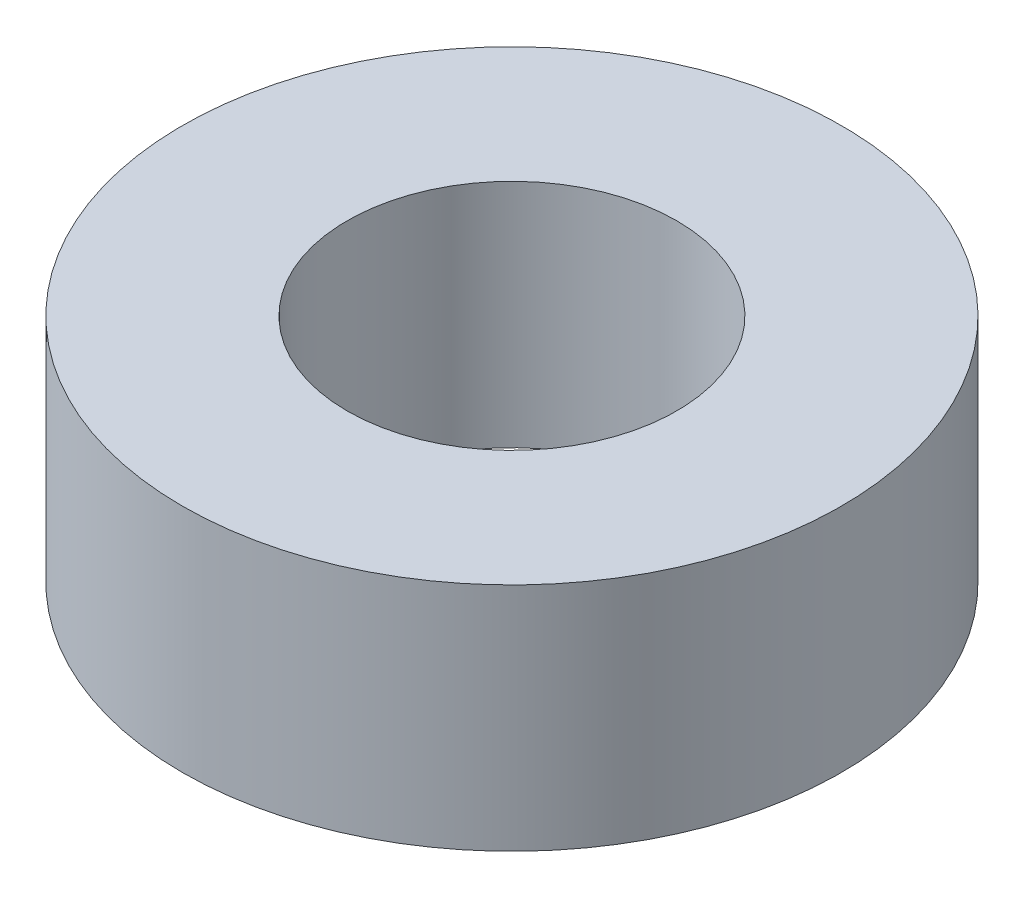
ISO-10303-21;
HEADER;
FILE_DESCRIPTION(('STEP AP214'),'2;1');
FILE_NAME('part.step','',(''),(''),'','','');
FILE_SCHEMA(('AUTOMOTIVE_DESIGN { 1 0 10303 214 1 1 1 1 }'));
ENDSEC;
DATA;
#1=APPLICATION_CONTEXT('core data for automotive mechanical design processes');
#2=APPLICATION_PROTOCOL_DEFINITION('international standard','automotive_design',2000,#1);
#3=PRODUCT_CONTEXT('',#1,'mechanical');
#4=PRODUCT('Part','Part','',(#3));
#5=PRODUCT_RELATED_PRODUCT_CATEGORY('part','',(#4));
#6=PRODUCT_DEFINITION_FORMATION('','',#4);
#7=PRODUCT_DEFINITION_CONTEXT('part definition',#1,'design');
#8=PRODUCT_DEFINITION('design','',#6,#7);
#9=PRODUCT_DEFINITION_SHAPE('','',#8);
#10=(LENGTH_UNIT() NAMED_UNIT(*) SI_UNIT(.MILLI.,.METRE.));
#11=(NAMED_UNIT(*) PLANE_ANGLE_UNIT() SI_UNIT($,.RADIAN.));
#12=(NAMED_UNIT(*) SI_UNIT($,.STERADIAN.) SOLID_ANGLE_UNIT());
#13=UNCERTAINTY_MEASURE_WITH_UNIT(LENGTH_MEASURE(1.E-05),#10,'distance_accuracy_value','');
#14=(GEOMETRIC_REPRESENTATION_CONTEXT(3) GLOBAL_UNCERTAINTY_ASSIGNED_CONTEXT((#13)) GLOBAL_UNIT_ASSIGNED_CONTEXT((#10,
#11,#12)) REPRESENTATION_CONTEXT('',''));
#15=CARTESIAN_POINT('',(0.,0.,0.));
#16=DIRECTION('',(0.,0.,1.));
#17=DIRECTION('',(1.,0.,0.));
#18=AXIS2_PLACEMENT_3D('',#15,#16,#17);
#19=CARTESIAN_POINT('',(0.,28.,0.));
#20=DIRECTION('',(0.,1.,0.));
#21=DIRECTION('',(0.,0.,1.));
#22=AXIS2_PLACEMENT_3D('',#19,#20,#21);
#23=PLANE('',#22);
#24=CARTESIAN_POINT('',(0.,28.,0.));
#25=DIRECTION('',(0.,1.,0.));
#26=DIRECTION('',(0.,0.,1.));
#27=AXIS2_PLACEMENT_3D('',#24,#25,#26);
#28=CIRCLE('',#27,40.);
#29=CARTESIAN_POINT('',(0.,28.,40.));
#30=VERTEX_POINT('',#29);
#31=EDGE_CURVE('E10',#30,#30,#28,.T.);
#32=ORIENTED_EDGE('',*,*,#31,.T.);
#33=EDGE_LOOP('',(#32));
#34=FACE_BOUND('',#33,.T.);
#35=CARTESIAN_POINT('',(0.,28.,0.));
#36=DIRECTION('',(0.,1.,0.));
#37=DIRECTION('',(0.,0.,1.));
#38=AXIS2_PLACEMENT_3D('',#35,#36,#37);
#39=CIRCLE('',#38,20.);
#40=CARTESIAN_POINT('',(0.,28.,20.));
#41=VERTEX_POINT('',#40);
#42=EDGE_CURVE('E40',#41,#41,#39,.T.);
#43=ORIENTED_EDGE('',*,*,#42,.F.);
#44=EDGE_LOOP('',(#43));
#45=FACE_BOUND('',#44,.T.);
#46=ADVANCED_FACE('F29',(#34,#45),#23,.T.);
#47=CARTESIAN_POINT('',(0.,0.,0.));
#48=DIRECTION('',(0.,1.,0.));
#49=DIRECTION('',(0.,0.,1.));
#50=AXIS2_PLACEMENT_3D('',#47,#48,#49);
#51=PLANE('',#50);
#52=CARTESIAN_POINT('',(0.,0.,0.));
#53=DIRECTION('',(0.,1.,0.));
#54=DIRECTION('',(0.,0.,1.));
#55=AXIS2_PLACEMENT_3D('',#52,#53,#54);
#56=CIRCLE('',#55,40.);
#57=CARTESIAN_POINT('',(0.,0.,40.));
#58=VERTEX_POINT('',#57);
#59=EDGE_CURVE('E33',#58,#58,#56,.T.);
#60=ORIENTED_EDGE('',*,*,#59,.F.);
#61=EDGE_LOOP('',(#60));
#62=FACE_BOUND('',#61,.T.);
#63=CARTESIAN_POINT('',(0.,0.,0.));
#64=DIRECTION('',(0.,1.,0.));
#65=DIRECTION('',(0.,0.,1.));
#66=AXIS2_PLACEMENT_3D('',#63,#64,#65);
#67=CIRCLE('',#66,20.);
#68=CARTESIAN_POINT('',(0.,0.,20.));
#69=VERTEX_POINT('',#68);
#70=EDGE_CURVE('E42',#69,#69,#67,.T.);
#71=ORIENTED_EDGE('',*,*,#70,.T.);
#72=EDGE_LOOP('',(#71));
#73=FACE_BOUND('',#72,.T.);
#74=ADVANCED_FACE('F52',(#62,#73),#51,.F.);
#75=CARTESIAN_POINT('',(0.,28.,0.));
#76=DIRECTION('',(0.,-1.,0.));
#77=DIRECTION('',(0.,0.,-1.));
#78=AXIS2_PLACEMENT_3D('',#75,#76,#77);
#79=CYLINDRICAL_SURFACE('',#78,40.);
#80=ORIENTED_EDGE('',*,*,#31,.F.);
#81=EDGE_LOOP('',(#80));
#82=FACE_BOUND('',#81,.T.);
#83=ORIENTED_EDGE('',*,*,#59,.T.);
#84=EDGE_LOOP('',(#83));
#85=FACE_BOUND('',#84,.T.);
#86=ADVANCED_FACE('F31',(#82,#85),#79,.T.);
#87=CARTESIAN_POINT('',(0.,28.,0.));
#88=DIRECTION('',(0.,-1.,0.));
#89=DIRECTION('',(0.,0.,-1.));
#90=AXIS2_PLACEMENT_3D('',#87,#88,#89);
#91=CYLINDRICAL_SURFACE('',#90,20.);
#92=ORIENTED_EDGE('',*,*,#42,.T.);
#93=EDGE_LOOP('',(#92));
#94=FACE_BOUND('',#93,.T.);
#95=ORIENTED_EDGE('',*,*,#70,.F.);
#96=EDGE_LOOP('',(#95));
#97=FACE_BOUND('',#96,.T.);
#98=ADVANCED_FACE('F48',(#94,#97),#91,.F.);
#99=CLOSED_SHELL('',(#46,#74,#86,#98));
#100=MANIFOLD_SOLID_BREP('B2',#99);
#101=ADVANCED_BREP_SHAPE_REPRESENTATION('',(#18,#100),#14);
#102=SHAPE_DEFINITION_REPRESENTATION(#9,#101);
ENDSEC;
END-ISO-10303-21;
